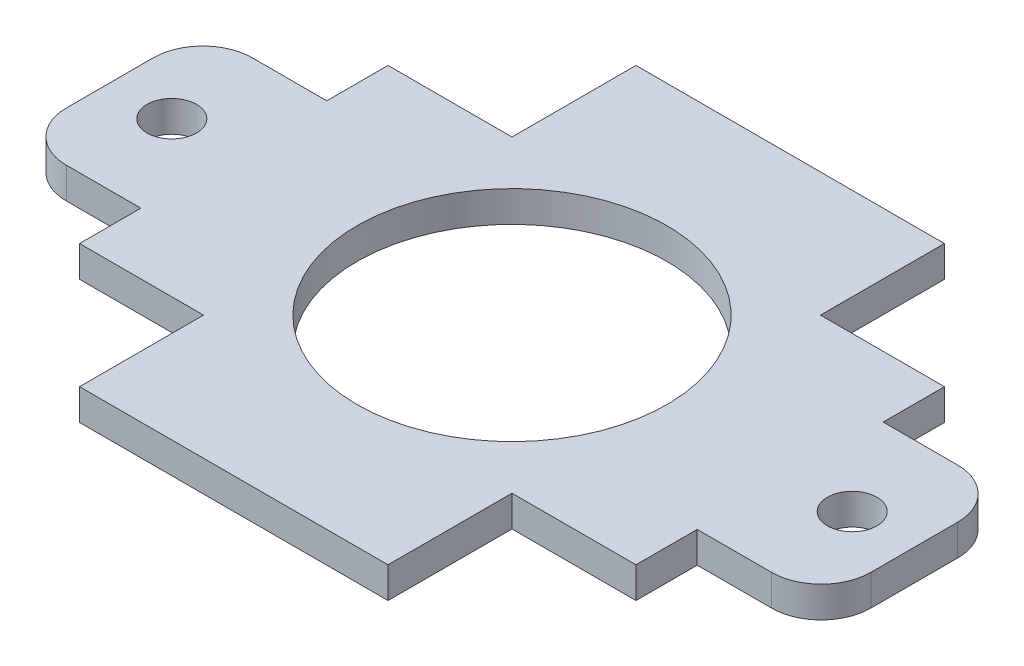
ISO-10303-21;
HEADER;
FILE_DESCRIPTION(('STEP AP214'),'2;1');
FILE_NAME('part.step','',(''),(''),'','','');
FILE_SCHEMA(('AUTOMOTIVE_DESIGN { 1 0 10303 214 1 1 1 1 }'));
ENDSEC;
DATA;
#1=APPLICATION_CONTEXT('core data for automotive mechanical design processes');
#2=APPLICATION_PROTOCOL_DEFINITION('international standard','automotive_design',2000,#1);
#3=PRODUCT_CONTEXT('',#1,'mechanical');
#4=PRODUCT('Part','Part','',(#3));
#5=PRODUCT_RELATED_PRODUCT_CATEGORY('part','',(#4));
#6=PRODUCT_DEFINITION_FORMATION('','',#4);
#7=PRODUCT_DEFINITION_CONTEXT('part definition',#1,'design');
#8=PRODUCT_DEFINITION('design','',#6,#7);
#9=PRODUCT_DEFINITION_SHAPE('','',#8);
#10=(LENGTH_UNIT() NAMED_UNIT(*) SI_UNIT(.MILLI.,.METRE.));
#11=(NAMED_UNIT(*) PLANE_ANGLE_UNIT() SI_UNIT($,.RADIAN.));
#12=(NAMED_UNIT(*) SI_UNIT($,.STERADIAN.) SOLID_ANGLE_UNIT());
#13=UNCERTAINTY_MEASURE_WITH_UNIT(LENGTH_MEASURE(1.E-05),#10,'distance_accuracy_value','');
#14=(GEOMETRIC_REPRESENTATION_CONTEXT(3) GLOBAL_UNCERTAINTY_ASSIGNED_CONTEXT((#13)) GLOBAL_UNIT_ASSIGNED_CONTEXT((#10,
#11,#12)) REPRESENTATION_CONTEXT('',''));
#15=CARTESIAN_POINT('',(0.,0.,0.));
#16=DIRECTION('',(0.,0.,1.));
#17=DIRECTION('',(1.,0.,0.));
#18=AXIS2_PLACEMENT_3D('',#15,#16,#17);
#19=CARTESIAN_POINT('',(-36.1199938,3.175,-4.44499999999998));
#20=DIRECTION('',(0.,1.,0.));
#21=DIRECTION('',(0.,0.,1.));
#22=AXIS2_PLACEMENT_3D('',#19,#20,#21);
#23=PLANE('',#22);
#24=CARTESIAN_POINT('',(-34.8499938,3.175,0.));
#25=DIRECTION('',(0.,1.,0.));
#26=DIRECTION('',(0.,0.,1.));
#27=AXIS2_PLACEMENT_3D('',#24,#25,#26);
#28=CIRCLE('',#27,2.54);
#29=CARTESIAN_POINT('',(-34.8499938,3.175,2.54000000000002));
#30=VERTEX_POINT('',#29);
#31=EDGE_CURVE('E444',#30,#30,#28,.T.);
#32=ORIENTED_EDGE('',*,*,#31,.F.);
#33=EDGE_LOOP('',(#32));
#34=FACE_BOUND('',#33,.T.);
#35=DIRECTION('',(-1.,0.,0.));
#36=VECTOR('',#35,1.);
#37=CARTESIAN_POINT('',(-28.4999938,3.175,-9.52499999999998));
#38=LINE('',#37,#36);
#39=CARTESIAN_POINT('',(-28.4999938,3.175,-9.52499999999998));
#40=VERTEX_POINT('',#39);
#41=CARTESIAN_POINT('',(-36.1199938,3.175,-9.52499999999998));
#42=VERTEX_POINT('',#41);
#43=EDGE_CURVE('E275',#40,#42,#38,.T.);
#44=ORIENTED_EDGE('',*,*,#43,.T.);
#45=CARTESIAN_POINT('',(-36.1199938,3.175,-4.44499999999998));
#46=DIRECTION('',(0.,1.,0.));
#47=DIRECTION('',(0.,0.,1.));
#48=AXIS2_PLACEMENT_3D('',#45,#46,#47);
#49=CIRCLE('',#48,5.08);
#50=CARTESIAN_POINT('',(-41.1999938,3.175,-4.44499999999998));
#51=VERTEX_POINT('',#50);
#52=EDGE_CURVE('E143',#42,#51,#49,.T.);
#53=ORIENTED_EDGE('',*,*,#52,.T.);
#54=DIRECTION('',(0.,0.,1.));
#55=VECTOR('',#54,1.);
#56=CARTESIAN_POINT('',(-41.1999938,3.175,4.44500000000002));
#57=LINE('',#56,#55);
#58=CARTESIAN_POINT('',(-41.1999938,3.175,4.44500000000002));
#59=VERTEX_POINT('',#58);
#60=EDGE_CURVE('E338',#51,#59,#57,.T.);
#61=ORIENTED_EDGE('',*,*,#60,.T.);
#62=CARTESIAN_POINT('',(-36.1199938,3.175,4.44500000000002));
#63=DIRECTION('',(0.,1.,0.));
#64=DIRECTION('',(0.,0.,-1.));
#65=AXIS2_PLACEMENT_3D('',#62,#63,#64);
#66=CIRCLE('',#65,5.08);
#67=CARTESIAN_POINT('',(-36.1199938,3.175,9.52500000000002));
#68=VERTEX_POINT('',#67);
#69=EDGE_CURVE('E357',#59,#68,#66,.T.);
#70=ORIENTED_EDGE('',*,*,#69,.T.);
#71=DIRECTION('',(1.,0.,0.));
#72=VECTOR('',#71,1.);
#73=CARTESIAN_POINT('',(-28.4999938,3.175,9.52500000000002));
#74=LINE('',#73,#72);
#75=CARTESIAN_POINT('',(-28.4999938,3.175,9.52500000000002));
#76=VERTEX_POINT('',#75);
#77=EDGE_CURVE('E354',#68,#76,#74,.T.);
#78=ORIENTED_EDGE('',*,*,#77,.T.);
#79=DIRECTION('',(0.,0.,1.));
#80=VECTOR('',#79,1.);
#81=CARTESIAN_POINT('',(-28.4999938,3.175,9.52500000000002));
#82=LINE('',#81,#80);
#83=CARTESIAN_POINT('',(-28.4999938,3.175,15.7999938));
#84=VERTEX_POINT('',#83);
#85=EDGE_CURVE('E356',#76,#84,#82,.T.);
#86=ORIENTED_EDGE('',*,*,#85,.T.);
#87=DIRECTION('',(1.,0.,0.));
#88=VECTOR('',#87,1.);
#89=CARTESIAN_POINT('',(-15.7999938,3.175,15.7999938));
#90=LINE('',#89,#88);
#91=CARTESIAN_POINT('',(-15.7999938,3.175,15.7999938));
#92=VERTEX_POINT('',#91);
#93=EDGE_CURVE('E359',#84,#92,#90,.T.);
#94=ORIENTED_EDGE('',*,*,#93,.T.);
#95=DIRECTION('',(0.,0.,1.));
#96=VECTOR('',#95,1.);
#97=CARTESIAN_POINT('',(-15.7999938,3.175,15.7999938));
#98=LINE('',#97,#96);
#99=CARTESIAN_POINT('',(-15.7999938,3.175,28.4999938));
#100=VERTEX_POINT('',#99);
#101=EDGE_CURVE('E365',#92,#100,#98,.T.);
#102=ORIENTED_EDGE('',*,*,#101,.T.);
#103=DIRECTION('',(1.,0.,0.));
#104=VECTOR('',#103,1.);
#105=CARTESIAN_POINT('',(15.7999938,3.175,28.4999938));
#106=LINE('',#105,#104);
#107=CARTESIAN_POINT('',(15.7999938,3.175,28.4999938));
#108=VERTEX_POINT('',#107);
#109=EDGE_CURVE('E367',#100,#108,#106,.T.);
#110=ORIENTED_EDGE('',*,*,#109,.T.);
#111=DIRECTION('',(0.,0.,-1.));
#112=VECTOR('',#111,1.);
#113=CARTESIAN_POINT('',(15.7999938,3.175,15.7999938));
#114=LINE('',#113,#112);
#115=CARTESIAN_POINT('',(15.7999938,3.175,15.7999938));
#116=VERTEX_POINT('',#115);
#117=EDGE_CURVE('E369',#108,#116,#114,.T.);
#118=ORIENTED_EDGE('',*,*,#117,.T.);
#119=DIRECTION('',(1.,0.,0.));
#120=VECTOR('',#119,1.);
#121=CARTESIAN_POINT('',(15.7999938,3.175,15.7999938));
#122=LINE('',#121,#120);
#123=CARTESIAN_POINT('',(28.4999938,3.175,15.7999938));
#124=VERTEX_POINT('',#123);
#125=EDGE_CURVE('E371',#116,#124,#122,.T.);
#126=ORIENTED_EDGE('',*,*,#125,.T.);
#127=DIRECTION('',(0.,0.,-1.));
#128=VECTOR('',#127,1.);
#129=CARTESIAN_POINT('',(28.4999938,3.175,9.52500000000002));
#130=LINE('',#129,#128);
#131=CARTESIAN_POINT('',(28.4999938,3.175,9.52500000000002));
#132=VERTEX_POINT('',#131);
#133=EDGE_CURVE('E373',#124,#132,#130,.T.);
#134=ORIENTED_EDGE('',*,*,#133,.T.);
#135=DIRECTION('',(1.,0.,0.));
#136=VECTOR('',#135,1.);
#137=CARTESIAN_POINT('',(28.4999938,3.175,9.52500000000002));
#138=LINE('',#137,#136);
#139=CARTESIAN_POINT('',(36.1199938,3.175,9.52500000000002));
#140=VERTEX_POINT('',#139);
#141=EDGE_CURVE('E375',#132,#140,#138,.T.);
#142=ORIENTED_EDGE('',*,*,#141,.T.);
#143=CARTESIAN_POINT('',(36.1199938,3.175,4.44500000000002));
#144=DIRECTION('',(0.,1.,0.));
#145=DIRECTION('',(0.,0.,1.));
#146=AXIS2_PLACEMENT_3D('',#143,#144,#145);
#147=CIRCLE('',#146,5.08);
#148=CARTESIAN_POINT('',(41.1999938,3.175,4.44500000000002));
#149=VERTEX_POINT('',#148);
#150=EDGE_CURVE('E377',#140,#149,#147,.T.);
#151=ORIENTED_EDGE('',*,*,#150,.T.);
#152=DIRECTION('',(0.,0.,-1.));
#153=VECTOR('',#152,1.);
#154=CARTESIAN_POINT('',(41.1999938,3.175,4.44500000000002));
#155=LINE('',#154,#153);
#156=CARTESIAN_POINT('',(41.1999938,3.175,-4.44499999999999));
#157=VERTEX_POINT('',#156);
#158=EDGE_CURVE('E379',#149,#157,#155,.T.);
#159=ORIENTED_EDGE('',*,*,#158,.T.);
#160=CARTESIAN_POINT('',(36.1199938,3.175,-4.44499999999999));
#161=DIRECTION('',(0.,1.,0.));
#162=DIRECTION('',(0.,0.,1.));
#163=AXIS2_PLACEMENT_3D('',#160,#161,#162);
#164=CIRCLE('',#163,5.08);
#165=CARTESIAN_POINT('',(36.1199938,3.175,-9.52499999999998));
#166=VERTEX_POINT('',#165);
#167=EDGE_CURVE('E381',#157,#166,#164,.T.);
#168=ORIENTED_EDGE('',*,*,#167,.T.);
#169=DIRECTION('',(-1.,0.,0.));
#170=VECTOR('',#169,1.);
#171=CARTESIAN_POINT('',(28.4999938,3.175,-9.52499999999998));
#172=LINE('',#171,#170);
#173=CARTESIAN_POINT('',(28.4999938,3.175,-9.52499999999998));
#174=VERTEX_POINT('',#173);
#175=EDGE_CURVE('E383',#166,#174,#172,.T.);
#176=ORIENTED_EDGE('',*,*,#175,.T.);
#177=DIRECTION('',(0.,0.,-1.));
#178=VECTOR('',#177,1.);
#179=CARTESIAN_POINT('',(28.4999938,3.175,-15.7999938));
#180=LINE('',#179,#178);
#181=CARTESIAN_POINT('',(28.4999938,3.175,-15.7999938));
#182=VERTEX_POINT('',#181);
#183=EDGE_CURVE('E385',#174,#182,#180,.T.);
#184=ORIENTED_EDGE('',*,*,#183,.T.);
#185=DIRECTION('',(-1.,0.,0.));
#186=VECTOR('',#185,1.);
#187=CARTESIAN_POINT('',(15.7999938,3.175,-15.7999938));
#188=LINE('',#187,#186);
#189=CARTESIAN_POINT('',(15.7999938,3.175,-15.7999938));
#190=VERTEX_POINT('',#189);
#191=EDGE_CURVE('E387',#182,#190,#188,.T.);
#192=ORIENTED_EDGE('',*,*,#191,.T.);
#193=DIRECTION('',(0.,0.,-1.));
#194=VECTOR('',#193,1.);
#195=CARTESIAN_POINT('',(15.7999938,3.175,-15.7999938));
#196=LINE('',#195,#194);
#197=CARTESIAN_POINT('',(15.7999938,3.175,-28.4999938));
#198=VERTEX_POINT('',#197);
#199=EDGE_CURVE('E389',#190,#198,#196,.T.);
#200=ORIENTED_EDGE('',*,*,#199,.T.);
#201=DIRECTION('',(-1.,0.,0.));
#202=VECTOR('',#201,1.);
#203=CARTESIAN_POINT('',(-15.7999938,3.175,-28.4999938));
#204=LINE('',#203,#202);
#205=CARTESIAN_POINT('',(-15.7999938,3.175,-28.4999938));
#206=VERTEX_POINT('',#205);
#207=EDGE_CURVE('E210',#198,#206,#204,.T.);
#208=ORIENTED_EDGE('',*,*,#207,.T.);
#209=DIRECTION('',(0.,0.,1.));
#210=VECTOR('',#209,1.);
#211=CARTESIAN_POINT('',(-15.7999938,3.175,-15.7999938));
#212=LINE('',#211,#210);
#213=CARTESIAN_POINT('',(-15.7999938,3.175,-15.7999938));
#214=VERTEX_POINT('',#213);
#215=EDGE_CURVE('E204',#206,#214,#212,.T.);
#216=ORIENTED_EDGE('',*,*,#215,.T.);
#217=DIRECTION('',(-1.,0.,0.));
#218=VECTOR('',#217,1.);
#219=CARTESIAN_POINT('',(-15.7999938,3.175,-15.7999938));
#220=LINE('',#219,#218);
#221=CARTESIAN_POINT('',(-28.4999938,3.175,-15.7999938));
#222=VERTEX_POINT('',#221);
#223=EDGE_CURVE('E208',#214,#222,#220,.T.);
#224=ORIENTED_EDGE('',*,*,#223,.T.);
#225=DIRECTION('',(0.,0.,1.));
#226=VECTOR('',#225,1.);
#227=CARTESIAN_POINT('',(-28.4999938,3.175,-15.7999938));
#228=LINE('',#227,#226);
#229=EDGE_CURVE('E52',#222,#40,#228,.T.);
#230=ORIENTED_EDGE('',*,*,#229,.T.);
#231=EDGE_LOOP('',(#44,#53,#61,#70,#78,#86,#94,#102,#110,#118,#126,#134,#142,#151,#159,#168,
#176,#184,#192,#200,#208,#216,#224,#230));
#232=FACE_BOUND('',#231,.T.);
#233=CARTESIAN_POINT('',(0.,3.175,0.));
#234=DIRECTION('',(0.,1.,0.));
#235=DIRECTION('',(0.,0.,1.));
#236=AXIS2_PLACEMENT_3D('',#233,#234,#235);
#237=CIRCLE('',#236,15.875);
#238=CARTESIAN_POINT('',(0.,3.175,15.875));
#239=VERTEX_POINT('',#238);
#240=EDGE_CURVE('E232',#239,#239,#237,.T.);
#241=ORIENTED_EDGE('',*,*,#240,.F.);
#242=EDGE_LOOP('',(#241));
#243=FACE_BOUND('',#242,.T.);
#244=CARTESIAN_POINT('',(34.8499938,3.175,0.));
#245=DIRECTION('',(0.,1.,0.));
#246=DIRECTION('',(0.,0.,-1.));
#247=AXIS2_PLACEMENT_3D('',#244,#245,#246);
#248=CIRCLE('',#247,2.54000000000002);
#249=CARTESIAN_POINT('',(34.8499938,3.175,-2.54));
#250=VERTEX_POINT('',#249);
#251=EDGE_CURVE('E435',#250,#250,#248,.T.);
#252=ORIENTED_EDGE('',*,*,#251,.F.);
#253=EDGE_LOOP('',(#252));
#254=FACE_BOUND('',#253,.T.);
#255=ADVANCED_FACE('F35',(#34,#232,#243,#254),#23,.T.);
#256=CARTESIAN_POINT('',(-36.1199938,0.,-4.44499999999998));
#257=DIRECTION('',(0.,1.,0.));
#258=DIRECTION('',(0.,0.,1.));
#259=AXIS2_PLACEMENT_3D('',#256,#257,#258);
#260=PLANE('',#259);
#261=DIRECTION('',(-1.,0.,0.));
#262=VECTOR('',#261,1.);
#263=CARTESIAN_POINT('',(-28.4999938,0.,-9.52499999999998));
#264=LINE('',#263,#262);
#265=CARTESIAN_POINT('',(-28.4999938,0.,-9.52499999999998));
#266=VERTEX_POINT('',#265);
#267=CARTESIAN_POINT('',(-36.1199938,0.,-9.52499999999998));
#268=VERTEX_POINT('',#267);
#269=EDGE_CURVE('E228',#266,#268,#264,.T.);
#270=ORIENTED_EDGE('',*,*,#269,.F.);
#271=DIRECTION('',(0.,0.,1.));
#272=VECTOR('',#271,1.);
#273=CARTESIAN_POINT('',(-28.4999938,0.,-15.7999938));
#274=LINE('',#273,#272);
#275=CARTESIAN_POINT('',(-28.4999938,0.,-15.7999938));
#276=VERTEX_POINT('',#275);
#277=EDGE_CURVE('E135',#276,#266,#274,.T.);
#278=ORIENTED_EDGE('',*,*,#277,.F.);
#279=DIRECTION('',(-1.,0.,0.));
#280=VECTOR('',#279,1.);
#281=CARTESIAN_POINT('',(-15.7999938,0.,-15.7999938));
#282=LINE('',#281,#280);
#283=CARTESIAN_POINT('',(-15.7999938,0.,-15.7999938));
#284=VERTEX_POINT('',#283);
#285=EDGE_CURVE('E129',#284,#276,#282,.T.);
#286=ORIENTED_EDGE('',*,*,#285,.F.);
#287=DIRECTION('',(0.,0.,1.));
#288=VECTOR('',#287,1.);
#289=CARTESIAN_POINT('',(-15.7999938,0.,-15.7999938));
#290=LINE('',#289,#288);
#291=CARTESIAN_POINT('',(-15.7999938,0.,-28.4999938));
#292=VERTEX_POINT('',#291);
#293=EDGE_CURVE('E218',#292,#284,#290,.T.);
#294=ORIENTED_EDGE('',*,*,#293,.F.);
#295=DIRECTION('',(-1.,0.,0.));
#296=VECTOR('',#295,1.);
#297=CARTESIAN_POINT('',(-15.7999938,0.,-28.4999938));
#298=LINE('',#297,#296);
#299=CARTESIAN_POINT('',(15.7999938,0.,-28.4999938));
#300=VERTEX_POINT('',#299);
#301=EDGE_CURVE('E270',#300,#292,#298,.T.);
#302=ORIENTED_EDGE('',*,*,#301,.F.);
#303=DIRECTION('',(0.,0.,-1.));
#304=VECTOR('',#303,1.);
#305=CARTESIAN_POINT('',(15.7999938,0.,-15.7999938));
#306=LINE('',#305,#304);
#307=CARTESIAN_POINT('',(15.7999938,0.,-15.7999938));
#308=VERTEX_POINT('',#307);
#309=EDGE_CURVE('E268',#308,#300,#306,.T.);
#310=ORIENTED_EDGE('',*,*,#309,.F.);
#311=DIRECTION('',(-1.,0.,0.));
#312=VECTOR('',#311,1.);
#313=CARTESIAN_POINT('',(15.7999938,0.,-15.7999938));
#314=LINE('',#313,#312);
#315=CARTESIAN_POINT('',(28.4999938,0.,-15.7999938));
#316=VERTEX_POINT('',#315);
#317=EDGE_CURVE('E266',#316,#308,#314,.T.);
#318=ORIENTED_EDGE('',*,*,#317,.F.);
#319=DIRECTION('',(0.,0.,-1.));
#320=VECTOR('',#319,1.);
#321=CARTESIAN_POINT('',(28.4999938,0.,-15.7999938));
#322=LINE('',#321,#320);
#323=CARTESIAN_POINT('',(28.4999938,0.,-9.52499999999998));
#324=VERTEX_POINT('',#323);
#325=EDGE_CURVE('E264',#324,#316,#322,.T.);
#326=ORIENTED_EDGE('',*,*,#325,.F.);
#327=DIRECTION('',(-1.,0.,0.));
#328=VECTOR('',#327,1.);
#329=CARTESIAN_POINT('',(28.4999938,0.,-9.52499999999998));
#330=LINE('',#329,#328);
#331=CARTESIAN_POINT('',(36.1199938,0.,-9.52499999999998));
#332=VERTEX_POINT('',#331);
#333=EDGE_CURVE('E262',#332,#324,#330,.T.);
#334=ORIENTED_EDGE('',*,*,#333,.F.);
#335=CARTESIAN_POINT('',(36.1199938,0.,-4.44499999999999));
#336=DIRECTION('',(0.,1.,0.));
#337=DIRECTION('',(0.,0.,1.));
#338=AXIS2_PLACEMENT_3D('',#335,#336,#337);
#339=CIRCLE('',#338,5.08);
#340=CARTESIAN_POINT('',(41.1999938,0.,-4.44499999999999));
#341=VERTEX_POINT('',#340);
#342=EDGE_CURVE('E260',#341,#332,#339,.T.);
#343=ORIENTED_EDGE('',*,*,#342,.F.);
#344=DIRECTION('',(0.,0.,-1.));
#345=VECTOR('',#344,1.);
#346=CARTESIAN_POINT('',(41.1999938,0.,4.44500000000002));
#347=LINE('',#346,#345);
#348=CARTESIAN_POINT('',(41.1999938,0.,4.44500000000002));
#349=VERTEX_POINT('',#348);
#350=EDGE_CURVE('E258',#349,#341,#347,.T.);
#351=ORIENTED_EDGE('',*,*,#350,.F.);
#352=CARTESIAN_POINT('',(36.1199938,0.,4.44500000000002));
#353=DIRECTION('',(0.,1.,0.));
#354=DIRECTION('',(0.,0.,1.));
#355=AXIS2_PLACEMENT_3D('',#352,#353,#354);
#356=CIRCLE('',#355,5.08);
#357=CARTESIAN_POINT('',(36.1199938,0.,9.52500000000002));
#358=VERTEX_POINT('',#357);
#359=EDGE_CURVE('E256',#358,#349,#356,.T.);
#360=ORIENTED_EDGE('',*,*,#359,.F.);
#361=DIRECTION('',(1.,0.,0.));
#362=VECTOR('',#361,1.);
#363=CARTESIAN_POINT('',(28.4999938,0.,9.52500000000002));
#364=LINE('',#363,#362);
#365=CARTESIAN_POINT('',(28.4999938,0.,9.52500000000002));
#366=VERTEX_POINT('',#365);
#367=EDGE_CURVE('E254',#366,#358,#364,.T.);
#368=ORIENTED_EDGE('',*,*,#367,.F.);
#369=DIRECTION('',(0.,0.,-1.));
#370=VECTOR('',#369,1.);
#371=CARTESIAN_POINT('',(28.4999938,0.,9.52500000000002));
#372=LINE('',#371,#370);
#373=CARTESIAN_POINT('',(28.4999938,0.,15.7999938));
#374=VERTEX_POINT('',#373);
#375=EDGE_CURVE('E252',#374,#366,#372,.T.);
#376=ORIENTED_EDGE('',*,*,#375,.F.);
#377=DIRECTION('',(1.,0.,0.));
#378=VECTOR('',#377,1.);
#379=CARTESIAN_POINT('',(15.7999938,0.,15.7999938));
#380=LINE('',#379,#378);
#381=CARTESIAN_POINT('',(15.7999938,0.,15.7999938));
#382=VERTEX_POINT('',#381);
#383=EDGE_CURVE('E250',#382,#374,#380,.T.);
#384=ORIENTED_EDGE('',*,*,#383,.F.);
#385=DIRECTION('',(0.,0.,-1.));
#386=VECTOR('',#385,1.);
#387=CARTESIAN_POINT('',(15.7999938,0.,15.7999938));
#388=LINE('',#387,#386);
#389=CARTESIAN_POINT('',(15.7999938,0.,28.4999938));
#390=VERTEX_POINT('',#389);
#391=EDGE_CURVE('E248',#390,#382,#388,.T.);
#392=ORIENTED_EDGE('',*,*,#391,.F.);
#393=DIRECTION('',(1.,0.,0.));
#394=VECTOR('',#393,1.);
#395=CARTESIAN_POINT('',(15.7999938,0.,28.4999938));
#396=LINE('',#395,#394);
#397=CARTESIAN_POINT('',(-15.7999938,0.,28.4999938));
#398=VERTEX_POINT('',#397);
#399=EDGE_CURVE('E246',#398,#390,#396,.T.);
#400=ORIENTED_EDGE('',*,*,#399,.F.);
#401=DIRECTION('',(0.,0.,1.));
#402=VECTOR('',#401,1.);
#403=CARTESIAN_POINT('',(-15.7999938,0.,15.7999938));
#404=LINE('',#403,#402);
#405=CARTESIAN_POINT('',(-15.7999938,0.,15.7999938));
#406=VERTEX_POINT('',#405);
#407=EDGE_CURVE('E244',#406,#398,#404,.T.);
#408=ORIENTED_EDGE('',*,*,#407,.F.);
#409=DIRECTION('',(1.,0.,0.));
#410=VECTOR('',#409,1.);
#411=CARTESIAN_POINT('',(-15.7999938,0.,15.7999938));
#412=LINE('',#411,#410);
#413=CARTESIAN_POINT('',(-28.4999938,0.,15.7999938));
#414=VERTEX_POINT('',#413);
#415=EDGE_CURVE('E242',#414,#406,#412,.T.);
#416=ORIENTED_EDGE('',*,*,#415,.F.);
#417=DIRECTION('',(0.,0.,1.));
#418=VECTOR('',#417,1.);
#419=CARTESIAN_POINT('',(-28.4999938,0.,9.52500000000002));
#420=LINE('',#419,#418);
#421=CARTESIAN_POINT('',(-28.4999938,0.,9.52500000000002));
#422=VERTEX_POINT('',#421);
#423=EDGE_CURVE('E240',#422,#414,#420,.T.);
#424=ORIENTED_EDGE('',*,*,#423,.F.);
#425=DIRECTION('',(1.,0.,0.));
#426=VECTOR('',#425,1.);
#427=CARTESIAN_POINT('',(-28.4999938,0.,9.52500000000002));
#428=LINE('',#427,#426);
#429=CARTESIAN_POINT('',(-36.1199938,0.,9.52500000000002));
#430=VERTEX_POINT('',#429);
#431=EDGE_CURVE('E238',#430,#422,#428,.T.);
#432=ORIENTED_EDGE('',*,*,#431,.F.);
#433=CARTESIAN_POINT('',(-36.1199938,0.,4.44500000000002));
#434=DIRECTION('',(0.,1.,0.));
#435=DIRECTION('',(0.,0.,-1.));
#436=AXIS2_PLACEMENT_3D('',#433,#434,#435);
#437=CIRCLE('',#436,5.08);
#438=CARTESIAN_POINT('',(-41.1999938,0.,4.44500000000002));
#439=VERTEX_POINT('',#438);
#440=EDGE_CURVE('E236',#439,#430,#437,.T.);
#441=ORIENTED_EDGE('',*,*,#440,.F.);
#442=DIRECTION('',(0.,0.,1.));
#443=VECTOR('',#442,1.);
#444=CARTESIAN_POINT('',(-41.1999938,0.,4.44500000000002));
#445=LINE('',#444,#443);
#446=CARTESIAN_POINT('',(-41.1999938,0.,-4.44499999999998));
#447=VERTEX_POINT('',#446);
#448=EDGE_CURVE('E234',#447,#439,#445,.T.);
#449=ORIENTED_EDGE('',*,*,#448,.F.);
#450=CARTESIAN_POINT('',(-36.1199938,0.,-4.44499999999998));
#451=DIRECTION('',(0.,1.,0.));
#452=DIRECTION('',(0.,0.,1.));
#453=AXIS2_PLACEMENT_3D('',#450,#451,#452);
#454=CIRCLE('',#453,5.08);
#455=EDGE_CURVE('E231',#268,#447,#454,.T.);
#456=ORIENTED_EDGE('',*,*,#455,.F.);
#457=EDGE_LOOP('',(#270,#278,#286,#294,#302,#310,#318,#326,#334,#343,#351,#360,#368,#376,#384,
#392,#400,#408,#416,#424,#432,#441,#449,#456));
#458=FACE_BOUND('',#457,.T.);
#459=CARTESIAN_POINT('',(0.,0.,0.));
#460=DIRECTION('',(0.,1.,0.));
#461=DIRECTION('',(0.,0.,1.));
#462=AXIS2_PLACEMENT_3D('',#459,#460,#461);
#463=CIRCLE('',#462,15.875);
#464=CARTESIAN_POINT('',(0.,0.,15.875));
#465=VERTEX_POINT('',#464);
#466=EDGE_CURVE('E447',#465,#465,#463,.T.);
#467=ORIENTED_EDGE('',*,*,#466,.T.);
#468=EDGE_LOOP('',(#467));
#469=FACE_BOUND('',#468,.T.);
#470=CARTESIAN_POINT('',(-34.8499938,0.,0.));
#471=DIRECTION('',(0.,1.,0.));
#472=DIRECTION('',(0.,0.,1.));
#473=AXIS2_PLACEMENT_3D('',#470,#471,#472);
#474=CIRCLE('',#473,2.54);
#475=CARTESIAN_POINT('',(-34.8499938,0.,2.54000000000002));
#476=VERTEX_POINT('',#475);
#477=EDGE_CURVE('E441',#476,#476,#474,.T.);
#478=ORIENTED_EDGE('',*,*,#477,.T.);
#479=EDGE_LOOP('',(#478));
#480=FACE_BOUND('',#479,.T.);
#481=CARTESIAN_POINT('',(34.8499938,0.,0.));
#482=DIRECTION('',(0.,1.,0.));
#483=DIRECTION('',(0.,0.,-1.));
#484=AXIS2_PLACEMENT_3D('',#481,#482,#483);
#485=CIRCLE('',#484,2.54000000000002);
#486=CARTESIAN_POINT('',(34.8499938,0.,-2.54));
#487=VERTEX_POINT('',#486);
#488=EDGE_CURVE('E438',#487,#487,#485,.T.);
#489=ORIENTED_EDGE('',*,*,#488,.T.);
#490=EDGE_LOOP('',(#489));
#491=FACE_BOUND('',#490,.T.);
#492=ADVANCED_FACE('F342',(#458,#469,#480,#491),#260,.F.);
#493=CARTESIAN_POINT('',(-28.4999938,3.175,-9.52499999999998));
#494=DIRECTION('',(0.,0.,1.));
#495=DIRECTION('',(1.,0.,0.));
#496=AXIS2_PLACEMENT_3D('',#493,#494,#495);
#497=PLANE('',#496);
#498=ORIENTED_EDGE('',*,*,#269,.T.);
#499=DIRECTION('',(0.,-1.,0.));
#500=VECTOR('',#499,1.);
#501=CARTESIAN_POINT('',(-36.1199938,3.175,-9.52499999999998));
#502=LINE('',#501,#500);
#503=EDGE_CURVE('E11',#42,#268,#502,.T.);
#504=ORIENTED_EDGE('',*,*,#503,.F.);
#505=ORIENTED_EDGE('',*,*,#43,.F.);
#506=DIRECTION('',(0.,-1.,0.));
#507=VECTOR('',#506,1.);
#508=CARTESIAN_POINT('',(-28.4999938,3.175,-9.52499999999998));
#509=LINE('',#508,#507);
#510=EDGE_CURVE('E224',#40,#266,#509,.T.);
#511=ORIENTED_EDGE('',*,*,#510,.T.);
#512=EDGE_LOOP('',(#498,#504,#505,#511));
#513=FACE_BOUND('',#512,.T.);
#514=ADVANCED_FACE('F37',(#513),#497,.F.);
#515=CARTESIAN_POINT('',(-36.1199938,3.175,-4.44499999999998));
#516=DIRECTION('',(0.,-1.,0.));
#517=DIRECTION('',(0.,0.,-1.));
#518=AXIS2_PLACEMENT_3D('',#515,#516,#517);
#519=CYLINDRICAL_SURFACE('',#518,5.08);
#520=ORIENTED_EDGE('',*,*,#455,.T.);
#521=DIRECTION('',(0.,-1.,0.));
#522=VECTOR('',#521,1.);
#523=CARTESIAN_POINT('',(-41.1999938,3.175,-4.44499999999998));
#524=LINE('',#523,#522);
#525=EDGE_CURVE('E44',#51,#447,#524,.T.);
#526=ORIENTED_EDGE('',*,*,#525,.F.);
#527=ORIENTED_EDGE('',*,*,#52,.F.);
#528=ORIENTED_EDGE('',*,*,#503,.T.);
#529=EDGE_LOOP('',(#520,#526,#527,#528));
#530=FACE_BOUND('',#529,.T.);
#531=ADVANCED_FACE('F669',(#530),#519,.T.);
#532=CARTESIAN_POINT('',(-41.1999938,3.175,4.44500000000002));
#533=DIRECTION('',(1.,0.,0.));
#534=DIRECTION('',(0.,0.,-1.));
#535=AXIS2_PLACEMENT_3D('',#532,#533,#534);
#536=PLANE('',#535);
#537=ORIENTED_EDGE('',*,*,#448,.T.);
#538=DIRECTION('',(0.,-1.,0.));
#539=VECTOR('',#538,1.);
#540=CARTESIAN_POINT('',(-41.1999938,3.175,4.44500000000002));
#541=LINE('',#540,#539);
#542=EDGE_CURVE('E330',#59,#439,#541,.T.);
#543=ORIENTED_EDGE('',*,*,#542,.F.);
#544=ORIENTED_EDGE('',*,*,#60,.F.);
#545=ORIENTED_EDGE('',*,*,#525,.T.);
#546=EDGE_LOOP('',(#537,#543,#544,#545));
#547=FACE_BOUND('',#546,.T.);
#548=ADVANCED_FACE('F336',(#547),#536,.F.);
#549=CARTESIAN_POINT('',(-36.1199938,3.175,4.44500000000002));
#550=DIRECTION('',(0.,-1.,0.));
#551=DIRECTION('',(0.,0.,-1.));
#552=AXIS2_PLACEMENT_3D('',#549,#550,#551);
#553=CYLINDRICAL_SURFACE('',#552,5.08);
#554=ORIENTED_EDGE('',*,*,#440,.T.);
#555=DIRECTION('',(0.,-1.,0.));
#556=VECTOR('',#555,1.);
#557=CARTESIAN_POINT('',(-36.1199938,3.175,9.52500000000002));
#558=LINE('',#557,#556);
#559=EDGE_CURVE('E327',#68,#430,#558,.T.);
#560=ORIENTED_EDGE('',*,*,#559,.F.);
#561=ORIENTED_EDGE('',*,*,#69,.F.);
#562=ORIENTED_EDGE('',*,*,#542,.T.);
#563=EDGE_LOOP('',(#554,#560,#561,#562));
#564=FACE_BOUND('',#563,.T.);
#565=ADVANCED_FACE('F348',(#564),#553,.T.);
#566=CARTESIAN_POINT('',(-28.4999938,3.175,9.52500000000002));
#567=DIRECTION('',(0.,0.,-1.));
#568=DIRECTION('',(-1.,0.,0.));
#569=AXIS2_PLACEMENT_3D('',#566,#567,#568);
#570=PLANE('',#569);
#571=ORIENTED_EDGE('',*,*,#431,.T.);
#572=DIRECTION('',(0.,-1.,0.));
#573=VECTOR('',#572,1.);
#574=CARTESIAN_POINT('',(-28.4999938,3.175,9.52500000000002));
#575=LINE('',#574,#573);
#576=EDGE_CURVE('E324',#76,#422,#575,.T.);
#577=ORIENTED_EDGE('',*,*,#576,.F.);
#578=ORIENTED_EDGE('',*,*,#77,.F.);
#579=ORIENTED_EDGE('',*,*,#559,.T.);
#580=EDGE_LOOP('',(#571,#577,#578,#579));
#581=FACE_BOUND('',#580,.T.);
#582=ADVANCED_FACE('F352',(#581),#570,.F.);
#583=CARTESIAN_POINT('',(-28.4999938,3.175,9.52500000000002));
#584=DIRECTION('',(1.,0.,0.));
#585=DIRECTION('',(0.,0.,-1.));
#586=AXIS2_PLACEMENT_3D('',#583,#584,#585);
#587=PLANE('',#586);
#588=ORIENTED_EDGE('',*,*,#423,.T.);
#589=DIRECTION('',(0.,-1.,0.));
#590=VECTOR('',#589,1.);
#591=CARTESIAN_POINT('',(-28.4999938,3.175,15.7999938));
#592=LINE('',#591,#590);
#593=EDGE_CURVE('E321',#84,#414,#592,.T.);
#594=ORIENTED_EDGE('',*,*,#593,.F.);
#595=ORIENTED_EDGE('',*,*,#85,.F.);
#596=ORIENTED_EDGE('',*,*,#576,.T.);
#597=EDGE_LOOP('',(#588,#594,#595,#596));
#598=FACE_BOUND('',#597,.T.);
#599=ADVANCED_FACE('F634',(#598),#587,.F.);
#600=CARTESIAN_POINT('',(-15.7999938,3.175,15.7999938));
#601=DIRECTION('',(0.,0.,-1.));
#602=DIRECTION('',(-1.,0.,0.));
#603=AXIS2_PLACEMENT_3D('',#600,#601,#602);
#604=PLANE('',#603);
#605=ORIENTED_EDGE('',*,*,#415,.T.);
#606=DIRECTION('',(0.,-1.,0.));
#607=VECTOR('',#606,1.);
#608=CARTESIAN_POINT('',(-15.7999938,3.175,15.7999938));
#609=LINE('',#608,#607);
#610=EDGE_CURVE('E318',#92,#406,#609,.T.);
#611=ORIENTED_EDGE('',*,*,#610,.F.);
#612=ORIENTED_EDGE('',*,*,#93,.F.);
#613=ORIENTED_EDGE('',*,*,#593,.T.);
#614=EDGE_LOOP('',(#605,#611,#612,#613));
#615=FACE_BOUND('',#614,.T.);
#616=ADVANCED_FACE('F624',(#615),#604,.F.);
#617=CARTESIAN_POINT('',(-15.7999938,3.175,15.7999938));
#618=DIRECTION('',(1.,0.,0.));
#619=DIRECTION('',(0.,0.,-1.));
#620=AXIS2_PLACEMENT_3D('',#617,#618,#619);
#621=PLANE('',#620);
#622=ORIENTED_EDGE('',*,*,#407,.T.);
#623=DIRECTION('',(0.,-1.,0.));
#624=VECTOR('',#623,1.);
#625=CARTESIAN_POINT('',(-15.7999938,3.175,28.4999938));
#626=LINE('',#625,#624);
#627=EDGE_CURVE('E315',#100,#398,#626,.T.);
#628=ORIENTED_EDGE('',*,*,#627,.F.);
#629=ORIENTED_EDGE('',*,*,#101,.F.);
#630=ORIENTED_EDGE('',*,*,#610,.T.);
#631=EDGE_LOOP('',(#622,#628,#629,#630));
#632=FACE_BOUND('',#631,.T.);
#633=ADVANCED_FACE('F614',(#632),#621,.F.);
#634=CARTESIAN_POINT('',(15.7999938,3.175,28.4999938));
#635=DIRECTION('',(0.,0.,-1.));
#636=DIRECTION('',(-1.,0.,0.));
#637=AXIS2_PLACEMENT_3D('',#634,#635,#636);
#638=PLANE('',#637);
#639=ORIENTED_EDGE('',*,*,#399,.T.);
#640=DIRECTION('',(0.,-1.,0.));
#641=VECTOR('',#640,1.);
#642=CARTESIAN_POINT('',(15.7999938,3.175,28.4999938));
#643=LINE('',#642,#641);
#644=EDGE_CURVE('E312',#108,#390,#643,.T.);
#645=ORIENTED_EDGE('',*,*,#644,.F.);
#646=ORIENTED_EDGE('',*,*,#109,.F.);
#647=ORIENTED_EDGE('',*,*,#627,.T.);
#648=EDGE_LOOP('',(#639,#645,#646,#647));
#649=FACE_BOUND('',#648,.T.);
#650=ADVANCED_FACE('F604',(#649),#638,.F.);
#651=CARTESIAN_POINT('',(15.7999938,3.175,15.7999938));
#652=DIRECTION('',(-1.,0.,0.));
#653=DIRECTION('',(0.,0.,1.));
#654=AXIS2_PLACEMENT_3D('',#651,#652,#653);
#655=PLANE('',#654);
#656=ORIENTED_EDGE('',*,*,#391,.T.);
#657=DIRECTION('',(0.,-1.,0.));
#658=VECTOR('',#657,1.);
#659=CARTESIAN_POINT('',(15.7999938,3.175,15.7999938));
#660=LINE('',#659,#658);
#661=EDGE_CURVE('E309',#116,#382,#660,.T.);
#662=ORIENTED_EDGE('',*,*,#661,.F.);
#663=ORIENTED_EDGE('',*,*,#117,.F.);
#664=ORIENTED_EDGE('',*,*,#644,.T.);
#665=EDGE_LOOP('',(#656,#662,#663,#664));
#666=FACE_BOUND('',#665,.T.);
#667=ADVANCED_FACE('F594',(#666),#655,.F.);
#668=CARTESIAN_POINT('',(15.7999938,3.175,15.7999938));
#669=DIRECTION('',(0.,0.,-1.));
#670=DIRECTION('',(-1.,0.,0.));
#671=AXIS2_PLACEMENT_3D('',#668,#669,#670);
#672=PLANE('',#671);
#673=ORIENTED_EDGE('',*,*,#383,.T.);
#674=DIRECTION('',(0.,-1.,0.));
#675=VECTOR('',#674,1.);
#676=CARTESIAN_POINT('',(28.4999938,3.175,15.7999938));
#677=LINE('',#676,#675);
#678=EDGE_CURVE('E306',#124,#374,#677,.T.);
#679=ORIENTED_EDGE('',*,*,#678,.F.);
#680=ORIENTED_EDGE('',*,*,#125,.F.);
#681=ORIENTED_EDGE('',*,*,#661,.T.);
#682=EDGE_LOOP('',(#673,#679,#680,#681));
#683=FACE_BOUND('',#682,.T.);
#684=ADVANCED_FACE('F584',(#683),#672,.F.);
#685=CARTESIAN_POINT('',(28.4999938,3.175,9.52500000000002));
#686=DIRECTION('',(-1.,0.,0.));
#687=DIRECTION('',(0.,0.,1.));
#688=AXIS2_PLACEMENT_3D('',#685,#686,#687);
#689=PLANE('',#688);
#690=ORIENTED_EDGE('',*,*,#375,.T.);
#691=DIRECTION('',(0.,-1.,0.));
#692=VECTOR('',#691,1.);
#693=CARTESIAN_POINT('',(28.4999938,3.175,9.52500000000002));
#694=LINE('',#693,#692);
#695=EDGE_CURVE('E303',#132,#366,#694,.T.);
#696=ORIENTED_EDGE('',*,*,#695,.F.);
#697=ORIENTED_EDGE('',*,*,#133,.F.);
#698=ORIENTED_EDGE('',*,*,#678,.T.);
#699=EDGE_LOOP('',(#690,#696,#697,#698));
#700=FACE_BOUND('',#699,.T.);
#701=ADVANCED_FACE('F574',(#700),#689,.F.);
#702=CARTESIAN_POINT('',(28.4999938,3.175,9.52500000000002));
#703=DIRECTION('',(0.,0.,-1.));
#704=DIRECTION('',(-1.,0.,0.));
#705=AXIS2_PLACEMENT_3D('',#702,#703,#704);
#706=PLANE('',#705);
#707=ORIENTED_EDGE('',*,*,#367,.T.);
#708=DIRECTION('',(0.,-1.,0.));
#709=VECTOR('',#708,1.);
#710=CARTESIAN_POINT('',(36.1199938,3.175,9.52500000000002));
#711=LINE('',#710,#709);
#712=EDGE_CURVE('E300',#140,#358,#711,.T.);
#713=ORIENTED_EDGE('',*,*,#712,.F.);
#714=ORIENTED_EDGE('',*,*,#141,.F.);
#715=ORIENTED_EDGE('',*,*,#695,.T.);
#716=EDGE_LOOP('',(#707,#713,#714,#715));
#717=FACE_BOUND('',#716,.T.);
#718=ADVANCED_FACE('F564',(#717),#706,.F.);
#719=CARTESIAN_POINT('',(36.1199938,3.175,4.44500000000002));
#720=DIRECTION('',(0.,-1.,0.));
#721=DIRECTION('',(0.,0.,-1.));
#722=AXIS2_PLACEMENT_3D('',#719,#720,#721);
#723=CYLINDRICAL_SURFACE('',#722,5.08);
#724=ORIENTED_EDGE('',*,*,#359,.T.);
#725=DIRECTION('',(0.,-1.,0.));
#726=VECTOR('',#725,1.);
#727=CARTESIAN_POINT('',(41.1999938,3.175,4.44500000000002));
#728=LINE('',#727,#726);
#729=EDGE_CURVE('E297',#149,#349,#728,.T.);
#730=ORIENTED_EDGE('',*,*,#729,.F.);
#731=ORIENTED_EDGE('',*,*,#150,.F.);
#732=ORIENTED_EDGE('',*,*,#712,.T.);
#733=EDGE_LOOP('',(#724,#730,#731,#732));
#734=FACE_BOUND('',#733,.T.);
#735=ADVANCED_FACE('F554',(#734),#723,.T.);
#736=CARTESIAN_POINT('',(41.1999938,3.175,4.44500000000002));
#737=DIRECTION('',(-1.,0.,0.));
#738=DIRECTION('',(0.,0.,1.));
#739=AXIS2_PLACEMENT_3D('',#736,#737,#738);
#740=PLANE('',#739);
#741=ORIENTED_EDGE('',*,*,#350,.T.);
#742=DIRECTION('',(0.,-1.,0.));
#743=VECTOR('',#742,1.);
#744=CARTESIAN_POINT('',(41.1999938,3.175,-4.44499999999999));
#745=LINE('',#744,#743);
#746=EDGE_CURVE('E294',#157,#341,#745,.T.);
#747=ORIENTED_EDGE('',*,*,#746,.F.);
#748=ORIENTED_EDGE('',*,*,#158,.F.);
#749=ORIENTED_EDGE('',*,*,#729,.T.);
#750=EDGE_LOOP('',(#741,#747,#748,#749));
#751=FACE_BOUND('',#750,.T.);
#752=ADVANCED_FACE('F544',(#751),#740,.F.);
#753=CARTESIAN_POINT('',(36.1199938,3.175,-4.44499999999999));
#754=DIRECTION('',(0.,-1.,0.));
#755=DIRECTION('',(0.,0.,-1.));
#756=AXIS2_PLACEMENT_3D('',#753,#754,#755);
#757=CYLINDRICAL_SURFACE('',#756,5.08);
#758=ORIENTED_EDGE('',*,*,#342,.T.);
#759=DIRECTION('',(0.,-1.,0.));
#760=VECTOR('',#759,1.);
#761=CARTESIAN_POINT('',(36.1199938,3.175,-9.52499999999998));
#762=LINE('',#761,#760);
#763=EDGE_CURVE('E291',#166,#332,#762,.T.);
#764=ORIENTED_EDGE('',*,*,#763,.F.);
#765=ORIENTED_EDGE('',*,*,#167,.F.);
#766=ORIENTED_EDGE('',*,*,#746,.T.);
#767=EDGE_LOOP('',(#758,#764,#765,#766));
#768=FACE_BOUND('',#767,.T.);
#769=ADVANCED_FACE('F534',(#768),#757,.T.);
#770=CARTESIAN_POINT('',(28.4999938,3.175,-9.52499999999998));
#771=DIRECTION('',(0.,0.,1.));
#772=DIRECTION('',(1.,0.,0.));
#773=AXIS2_PLACEMENT_3D('',#770,#771,#772);
#774=PLANE('',#773);
#775=ORIENTED_EDGE('',*,*,#333,.T.);
#776=DIRECTION('',(0.,-1.,0.));
#777=VECTOR('',#776,1.);
#778=CARTESIAN_POINT('',(28.4999938,3.175,-9.52499999999998));
#779=LINE('',#778,#777);
#780=EDGE_CURVE('E288',#174,#324,#779,.T.);
#781=ORIENTED_EDGE('',*,*,#780,.F.);
#782=ORIENTED_EDGE('',*,*,#175,.F.);
#783=ORIENTED_EDGE('',*,*,#763,.T.);
#784=EDGE_LOOP('',(#775,#781,#782,#783));
#785=FACE_BOUND('',#784,.T.);
#786=ADVANCED_FACE('F524',(#785),#774,.F.);
#787=CARTESIAN_POINT('',(28.4999938,3.175,-15.7999938));
#788=DIRECTION('',(-1.,0.,0.));
#789=DIRECTION('',(0.,0.,1.));
#790=AXIS2_PLACEMENT_3D('',#787,#788,#789);
#791=PLANE('',#790);
#792=ORIENTED_EDGE('',*,*,#325,.T.);
#793=DIRECTION('',(0.,-1.,0.));
#794=VECTOR('',#793,1.);
#795=CARTESIAN_POINT('',(28.4999938,3.175,-15.7999938));
#796=LINE('',#795,#794);
#797=EDGE_CURVE('E285',#182,#316,#796,.T.);
#798=ORIENTED_EDGE('',*,*,#797,.F.);
#799=ORIENTED_EDGE('',*,*,#183,.F.);
#800=ORIENTED_EDGE('',*,*,#780,.T.);
#801=EDGE_LOOP('',(#792,#798,#799,#800));
#802=FACE_BOUND('',#801,.T.);
#803=ADVANCED_FACE('F514',(#802),#791,.F.);
#804=CARTESIAN_POINT('',(15.7999938,3.175,-15.7999938));
#805=DIRECTION('',(0.,0.,1.));
#806=DIRECTION('',(1.,0.,0.));
#807=AXIS2_PLACEMENT_3D('',#804,#805,#806);
#808=PLANE('',#807);
#809=ORIENTED_EDGE('',*,*,#317,.T.);
#810=DIRECTION('',(0.,-1.,0.));
#811=VECTOR('',#810,1.);
#812=CARTESIAN_POINT('',(15.7999938,3.175,-15.7999938));
#813=LINE('',#812,#811);
#814=EDGE_CURVE('E282',#190,#308,#813,.T.);
#815=ORIENTED_EDGE('',*,*,#814,.F.);
#816=ORIENTED_EDGE('',*,*,#191,.F.);
#817=ORIENTED_EDGE('',*,*,#797,.T.);
#818=EDGE_LOOP('',(#809,#815,#816,#817));
#819=FACE_BOUND('',#818,.T.);
#820=ADVANCED_FACE('F505',(#819),#808,.F.);
#821=CARTESIAN_POINT('',(15.7999938,3.175,-15.7999938));
#822=DIRECTION('',(-1.,0.,0.));
#823=DIRECTION('',(0.,0.,1.));
#824=AXIS2_PLACEMENT_3D('',#821,#822,#823);
#825=PLANE('',#824);
#826=ORIENTED_EDGE('',*,*,#309,.T.);
#827=DIRECTION('',(0.,-1.,0.));
#828=VECTOR('',#827,1.);
#829=CARTESIAN_POINT('',(15.7999938,3.175,-28.4999938));
#830=LINE('',#829,#828);
#831=EDGE_CURVE('E279',#198,#300,#830,.T.);
#832=ORIENTED_EDGE('',*,*,#831,.F.);
#833=ORIENTED_EDGE('',*,*,#199,.F.);
#834=ORIENTED_EDGE('',*,*,#814,.T.);
#835=EDGE_LOOP('',(#826,#832,#833,#834));
#836=FACE_BOUND('',#835,.T.);
#837=ADVANCED_FACE('F395',(#836),#825,.F.);
#838=CARTESIAN_POINT('',(-15.7999938,3.175,-28.4999938));
#839=DIRECTION('',(0.,0.,1.));
#840=DIRECTION('',(1.,0.,0.));
#841=AXIS2_PLACEMENT_3D('',#838,#839,#840);
#842=PLANE('',#841);
#843=ORIENTED_EDGE('',*,*,#301,.T.);
#844=DIRECTION('',(0.,-1.,0.));
#845=VECTOR('',#844,1.);
#846=CARTESIAN_POINT('',(-15.7999938,3.175,-28.4999938));
#847=LINE('',#846,#845);
#848=EDGE_CURVE('E219',#206,#292,#847,.T.);
#849=ORIENTED_EDGE('',*,*,#848,.F.);
#850=ORIENTED_EDGE('',*,*,#207,.F.);
#851=ORIENTED_EDGE('',*,*,#831,.T.);
#852=EDGE_LOOP('',(#843,#849,#850,#851));
#853=FACE_BOUND('',#852,.T.);
#854=ADVANCED_FACE('F399',(#853),#842,.F.);
#855=CARTESIAN_POINT('',(-15.7999938,3.175,-15.7999938));
#856=DIRECTION('',(1.,0.,0.));
#857=DIRECTION('',(0.,0.,-1.));
#858=AXIS2_PLACEMENT_3D('',#855,#856,#857);
#859=PLANE('',#858);
#860=ORIENTED_EDGE('',*,*,#293,.T.);
#861=DIRECTION('',(0.,-1.,0.));
#862=VECTOR('',#861,1.);
#863=CARTESIAN_POINT('',(-15.7999938,3.175,-15.7999938));
#864=LINE('',#863,#862);
#865=EDGE_CURVE('E215',#214,#284,#864,.T.);
#866=ORIENTED_EDGE('',*,*,#865,.F.);
#867=ORIENTED_EDGE('',*,*,#215,.F.);
#868=ORIENTED_EDGE('',*,*,#848,.T.);
#869=EDGE_LOOP('',(#860,#866,#867,#868));
#870=FACE_BOUND('',#869,.T.);
#871=ADVANCED_FACE('F216',(#870),#859,.F.);
#872=CARTESIAN_POINT('',(-15.7999938,3.175,-15.7999938));
#873=DIRECTION('',(0.,0.,1.));
#874=DIRECTION('',(1.,0.,0.));
#875=AXIS2_PLACEMENT_3D('',#872,#873,#874);
#876=PLANE('',#875);
#877=ORIENTED_EDGE('',*,*,#285,.T.);
#878=DIRECTION('',(0.,-1.,0.));
#879=VECTOR('',#878,1.);
#880=CARTESIAN_POINT('',(-28.4999938,3.175,-15.7999938));
#881=LINE('',#880,#879);
#882=EDGE_CURVE('E220',#222,#276,#881,.T.);
#883=ORIENTED_EDGE('',*,*,#882,.F.);
#884=ORIENTED_EDGE('',*,*,#223,.F.);
#885=ORIENTED_EDGE('',*,*,#865,.T.);
#886=EDGE_LOOP('',(#877,#883,#884,#885));
#887=FACE_BOUND('',#886,.T.);
#888=ADVANCED_FACE('F222',(#887),#876,.F.);
#889=CARTESIAN_POINT('',(-28.4999938,3.175,-15.7999938));
#890=DIRECTION('',(1.,0.,0.));
#891=DIRECTION('',(0.,0.,-1.));
#892=AXIS2_PLACEMENT_3D('',#889,#890,#891);
#893=PLANE('',#892);
#894=ORIENTED_EDGE('',*,*,#277,.T.);
#895=ORIENTED_EDGE('',*,*,#510,.F.);
#896=ORIENTED_EDGE('',*,*,#229,.F.);
#897=ORIENTED_EDGE('',*,*,#882,.T.);
#898=EDGE_LOOP('',(#894,#895,#896,#897));
#899=FACE_BOUND('',#898,.T.);
#900=ADVANCED_FACE('F403',(#899),#893,.F.);
#901=CARTESIAN_POINT('',(0.,3.175,0.));
#902=DIRECTION('',(0.,-1.,0.));
#903=DIRECTION('',(0.,0.,-1.));
#904=AXIS2_PLACEMENT_3D('',#901,#902,#903);
#905=CYLINDRICAL_SURFACE('',#904,15.875);
#906=ORIENTED_EDGE('',*,*,#240,.T.);
#907=EDGE_LOOP('',(#906));
#908=FACE_BOUND('',#907,.T.);
#909=ORIENTED_EDGE('',*,*,#466,.F.);
#910=EDGE_LOOP('',(#909));
#911=FACE_BOUND('',#910,.T.);
#912=ADVANCED_FACE('F405',(#908,#911),#905,.F.);
#913=CARTESIAN_POINT('',(-34.8499938,3.175,0.));
#914=DIRECTION('',(0.,-1.,0.));
#915=DIRECTION('',(0.,0.,-1.));
#916=AXIS2_PLACEMENT_3D('',#913,#914,#915);
#917=CYLINDRICAL_SURFACE('',#916,2.54);
#918=ORIENTED_EDGE('',*,*,#31,.T.);
#919=EDGE_LOOP('',(#918));
#920=FACE_BOUND('',#919,.T.);
#921=ORIENTED_EDGE('',*,*,#477,.F.);
#922=EDGE_LOOP('',(#921));
#923=FACE_BOUND('',#922,.T.);
#924=ADVANCED_FACE('F411',(#920,#923),#917,.F.);
#925=CARTESIAN_POINT('',(34.8499938,3.175,0.));
#926=DIRECTION('',(0.,-1.,0.));
#927=DIRECTION('',(0.,0.,-1.));
#928=AXIS2_PLACEMENT_3D('',#925,#926,#927);
#929=CYLINDRICAL_SURFACE('',#928,2.54000000000002);
#930=ORIENTED_EDGE('',*,*,#251,.T.);
#931=EDGE_LOOP('',(#930));
#932=FACE_BOUND('',#931,.T.);
#933=ORIENTED_EDGE('',*,*,#488,.F.);
#934=EDGE_LOOP('',(#933));
#935=FACE_BOUND('',#934,.T.);
#936=ADVANCED_FACE('F426',(#932,#935),#929,.F.);
#937=CLOSED_SHELL('',(#255,#492,#514,#531,#548,#565,#582,#599,#616,#633,#650,#667,#684,#701,
#718,#735,#752,#769,#786,#803,#820,#837,#854,#871,#888,#900,#912,#924,#936));
#938=MANIFOLD_SOLID_BREP('B2',#937);
#939=ADVANCED_BREP_SHAPE_REPRESENTATION('',(#18,#938),#14);
#940=SHAPE_DEFINITION_REPRESENTATION(#9,#939);
ENDSEC;
END-ISO-10303-21;
